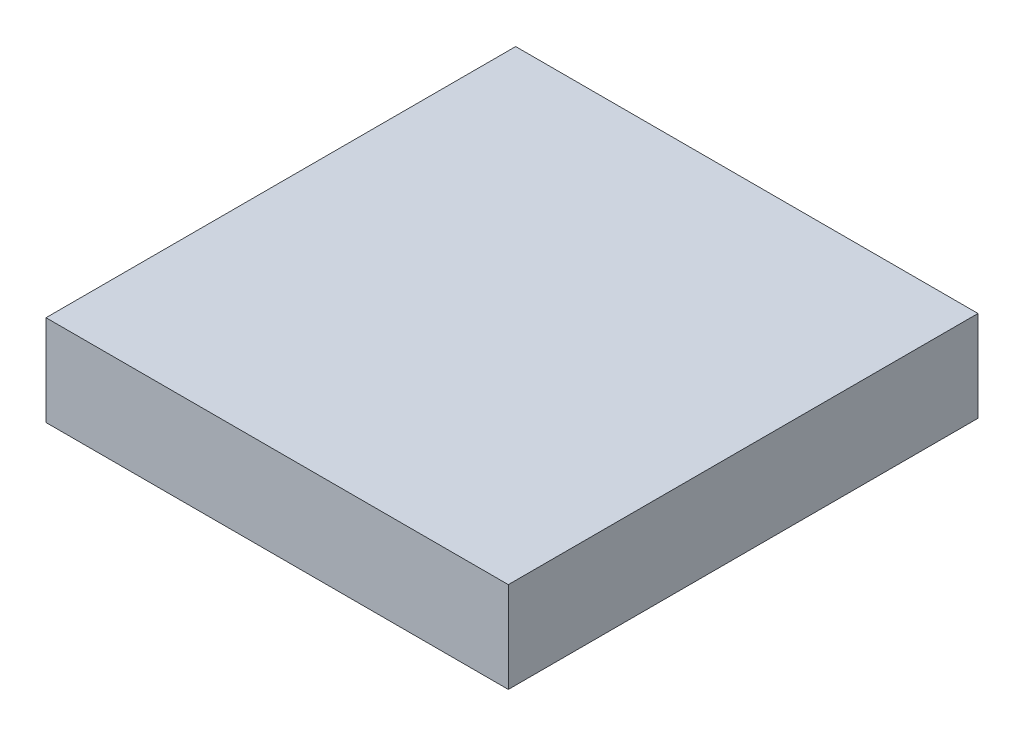
ISO-10303-21;
HEADER;
FILE_DESCRIPTION(('STEP AP214'),'2;1');
FILE_NAME('part.step','',(''),(''),'','','');
FILE_SCHEMA(('AUTOMOTIVE_DESIGN { 1 0 10303 214 1 1 1 1 }'));
ENDSEC;
DATA;
#1=APPLICATION_CONTEXT('core data for automotive mechanical design processes');
#2=APPLICATION_PROTOCOL_DEFINITION('international standard','automotive_design',2000,#1);
#3=PRODUCT_CONTEXT('',#1,'mechanical');
#4=PRODUCT('Part','Part','',(#3));
#5=PRODUCT_RELATED_PRODUCT_CATEGORY('part','',(#4));
#6=PRODUCT_DEFINITION_FORMATION('','',#4);
#7=PRODUCT_DEFINITION_CONTEXT('part definition',#1,'design');
#8=PRODUCT_DEFINITION('design','',#6,#7);
#9=PRODUCT_DEFINITION_SHAPE('','',#8);
#10=(LENGTH_UNIT() NAMED_UNIT(*) SI_UNIT(.MILLI.,.METRE.));
#11=(NAMED_UNIT(*) PLANE_ANGLE_UNIT() SI_UNIT($,.RADIAN.));
#12=(NAMED_UNIT(*) SI_UNIT($,.STERADIAN.) SOLID_ANGLE_UNIT());
#13=UNCERTAINTY_MEASURE_WITH_UNIT(LENGTH_MEASURE(1.E-05),#10,'distance_accuracy_value','');
#14=(GEOMETRIC_REPRESENTATION_CONTEXT(3) GLOBAL_UNCERTAINTY_ASSIGNED_CONTEXT((#13)) GLOBAL_UNIT_ASSIGNED_CONTEXT((#10,
#11,#12)) REPRESENTATION_CONTEXT('',''));
#15=CARTESIAN_POINT('',(0.,0.,0.));
#16=DIRECTION('',(0.,0.,1.));
#17=DIRECTION('',(1.,0.,0.));
#18=AXIS2_PLACEMENT_3D('',#15,#16,#17);
#19=CARTESIAN_POINT('',(-27.53125,17.3,-27.7033203125));
#20=DIRECTION('',(1.,0.,0.));
#21=DIRECTION('',(0.,0.,-1.));
#22=AXIS2_PLACEMENT_3D('',#19,#20,#21);
#23=PLANE('',#22);
#24=DIRECTION('',(0.,0.,1.));
#25=VECTOR('',#24,1.);
#26=CARTESIAN_POINT('',(-27.53125,0.,-27.7033203125));
#27=LINE('',#26,#25);
#28=CARTESIAN_POINT('',(-27.53125,0.,-27.7033203125));
#29=VERTEX_POINT('',#28);
#30=CARTESIAN_POINT('',(-27.53125,0.,61.7966796875));
#31=VERTEX_POINT('',#30);
#32=EDGE_CURVE('E107',#29,#31,#27,.T.);
#33=ORIENTED_EDGE('',*,*,#32,.T.);
#34=DIRECTION('',(0.,-1.,0.));
#35=VECTOR('',#34,1.);
#36=CARTESIAN_POINT('',(-27.53125,17.3,61.7966796875));
#37=LINE('',#36,#35);
#38=CARTESIAN_POINT('',(-27.53125,17.3,61.7966796875));
#39=VERTEX_POINT('',#38);
#40=EDGE_CURVE('E11',#39,#31,#37,.T.);
#41=ORIENTED_EDGE('',*,*,#40,.F.);
#42=DIRECTION('',(0.,0.,1.));
#43=VECTOR('',#42,1.);
#44=CARTESIAN_POINT('',(-27.53125,17.3,-27.7033203125));
#45=LINE('',#44,#43);
#46=CARTESIAN_POINT('',(-27.53125,17.3,-27.7033203125));
#47=VERTEX_POINT('',#46);
#48=EDGE_CURVE('E91',#47,#39,#45,.T.);
#49=ORIENTED_EDGE('',*,*,#48,.F.);
#50=DIRECTION('',(0.,-1.,0.));
#51=VECTOR('',#50,1.);
#52=CARTESIAN_POINT('',(-27.53125,17.3,-27.7033203125));
#53=LINE('',#52,#51);
#54=EDGE_CURVE('E103',#47,#29,#53,.T.);
#55=ORIENTED_EDGE('',*,*,#54,.T.);
#56=EDGE_LOOP('',(#33,#41,#49,#55));
#57=FACE_BOUND('',#56,.T.);
#58=ADVANCED_FACE('F39',(#57),#23,.F.);
#59=CARTESIAN_POINT('',(-27.53125,17.3,61.7966796875));
#60=DIRECTION('',(0.,0.,-1.));
#61=DIRECTION('',(-1.,0.,0.));
#62=AXIS2_PLACEMENT_3D('',#59,#60,#61);
#63=PLANE('',#62);
#64=DIRECTION('',(1.,0.,0.));
#65=VECTOR('',#64,1.);
#66=CARTESIAN_POINT('',(-27.53125,0.,61.7966796875));
#67=LINE('',#66,#65);
#68=CARTESIAN_POINT('',(60.56875,0.,61.7966796875));
#69=VERTEX_POINT('',#68);
#70=EDGE_CURVE('E96',#31,#69,#67,.T.);
#71=ORIENTED_EDGE('',*,*,#70,.T.);
#72=DIRECTION('',(0.,-1.,0.));
#73=VECTOR('',#72,1.);
#74=CARTESIAN_POINT('',(60.56875,17.3,61.7966796875));
#75=LINE('',#74,#73);
#76=CARTESIAN_POINT('',(60.56875,17.3,61.7966796875));
#77=VERTEX_POINT('',#76);
#78=EDGE_CURVE('E48',#77,#69,#75,.T.);
#79=ORIENTED_EDGE('',*,*,#78,.F.);
#80=DIRECTION('',(1.,0.,0.));
#81=VECTOR('',#80,1.);
#82=CARTESIAN_POINT('',(-27.53125,17.3,61.7966796875));
#83=LINE('',#82,#81);
#84=EDGE_CURVE('E86',#39,#77,#83,.T.);
#85=ORIENTED_EDGE('',*,*,#84,.F.);
#86=ORIENTED_EDGE('',*,*,#40,.T.);
#87=EDGE_LOOP('',(#71,#79,#85,#86));
#88=FACE_BOUND('',#87,.T.);
#89=ADVANCED_FACE('F95',(#88),#63,.F.);
#90=CARTESIAN_POINT('',(60.56875,17.3,-27.7033203125));
#91=DIRECTION('',(-1.,0.,0.));
#92=DIRECTION('',(0.,0.,1.));
#93=AXIS2_PLACEMENT_3D('',#90,#91,#92);
#94=PLANE('',#93);
#95=DIRECTION('',(0.,0.,-1.));
#96=VECTOR('',#95,1.);
#97=CARTESIAN_POINT('',(60.56875,0.,-27.7033203125));
#98=LINE('',#97,#96);
#99=CARTESIAN_POINT('',(60.56875,0.,-27.7033203125));
#100=VERTEX_POINT('',#99);
#101=EDGE_CURVE('E73',#69,#100,#98,.T.);
#102=ORIENTED_EDGE('',*,*,#101,.T.);
#103=DIRECTION('',(0.,-1.,0.));
#104=VECTOR('',#103,1.);
#105=CARTESIAN_POINT('',(60.56875,17.3,-27.7033203125));
#106=LINE('',#105,#104);
#107=CARTESIAN_POINT('',(60.56875,17.3,-27.7033203125));
#108=VERTEX_POINT('',#107);
#109=EDGE_CURVE('E98',#108,#100,#106,.T.);
#110=ORIENTED_EDGE('',*,*,#109,.F.);
#111=DIRECTION('',(0.,0.,-1.));
#112=VECTOR('',#111,1.);
#113=CARTESIAN_POINT('',(60.56875,17.3,-27.7033203125));
#114=LINE('',#113,#112);
#115=EDGE_CURVE('E89',#77,#108,#114,.T.);
#116=ORIENTED_EDGE('',*,*,#115,.F.);
#117=ORIENTED_EDGE('',*,*,#78,.T.);
#118=EDGE_LOOP('',(#102,#110,#116,#117));
#119=FACE_BOUND('',#118,.T.);
#120=ADVANCED_FACE('F99',(#119),#94,.F.);
#121=CARTESIAN_POINT('',(-27.53125,17.3,-27.7033203125));
#122=DIRECTION('',(0.,0.,1.));
#123=DIRECTION('',(1.,0.,0.));
#124=AXIS2_PLACEMENT_3D('',#121,#122,#123);
#125=PLANE('',#124);
#126=DIRECTION('',(-1.,0.,0.));
#127=VECTOR('',#126,1.);
#128=CARTESIAN_POINT('',(-27.53125,0.,-27.7033203125));
#129=LINE('',#128,#127);
#130=EDGE_CURVE('E79',#100,#29,#129,.T.);
#131=ORIENTED_EDGE('',*,*,#130,.T.);
#132=ORIENTED_EDGE('',*,*,#54,.F.);
#133=DIRECTION('',(-1.,0.,0.));
#134=VECTOR('',#133,1.);
#135=CARTESIAN_POINT('',(-27.53125,17.3,-27.7033203125));
#136=LINE('',#135,#134);
#137=EDGE_CURVE('E56',#108,#47,#136,.T.);
#138=ORIENTED_EDGE('',*,*,#137,.F.);
#139=ORIENTED_EDGE('',*,*,#109,.T.);
#140=EDGE_LOOP('',(#131,#132,#138,#139));
#141=FACE_BOUND('',#140,.T.);
#142=ADVANCED_FACE('F120',(#141),#125,.F.);
#143=CARTESIAN_POINT('',(0.,17.3,0.));
#144=DIRECTION('',(0.,1.,0.));
#145=DIRECTION('',(0.,0.,1.));
#146=AXIS2_PLACEMENT_3D('',#143,#144,#145);
#147=PLANE('',#146);
#148=ORIENTED_EDGE('',*,*,#48,.T.);
#149=ORIENTED_EDGE('',*,*,#84,.T.);
#150=ORIENTED_EDGE('',*,*,#115,.T.);
#151=ORIENTED_EDGE('',*,*,#137,.T.);
#152=EDGE_LOOP('',(#148,#149,#150,#151));
#153=FACE_BOUND('',#152,.T.);
#154=ADVANCED_FACE('F87',(#153),#147,.T.);
#155=CARTESIAN_POINT('',(0.,0.,0.));
#156=DIRECTION('',(0.,1.,0.));
#157=DIRECTION('',(0.,0.,1.));
#158=AXIS2_PLACEMENT_3D('',#155,#156,#157);
#159=PLANE('',#158);
#160=ORIENTED_EDGE('',*,*,#32,.F.);
#161=ORIENTED_EDGE('',*,*,#130,.F.);
#162=ORIENTED_EDGE('',*,*,#101,.F.);
#163=ORIENTED_EDGE('',*,*,#70,.F.);
#164=EDGE_LOOP('',(#160,#161,#162,#163));
#165=FACE_BOUND('',#164,.T.);
#166=ADVANCED_FACE('F123',(#165),#159,.F.);
#167=CLOSED_SHELL('',(#58,#89,#120,#142,#154,#166));
#168=MANIFOLD_SOLID_BREP('B2',#167);
#169=ADVANCED_BREP_SHAPE_REPRESENTATION('',(#18,#168),#14);
#170=SHAPE_DEFINITION_REPRESENTATION(#9,#169);
ENDSEC;
END-ISO-10303-21;
